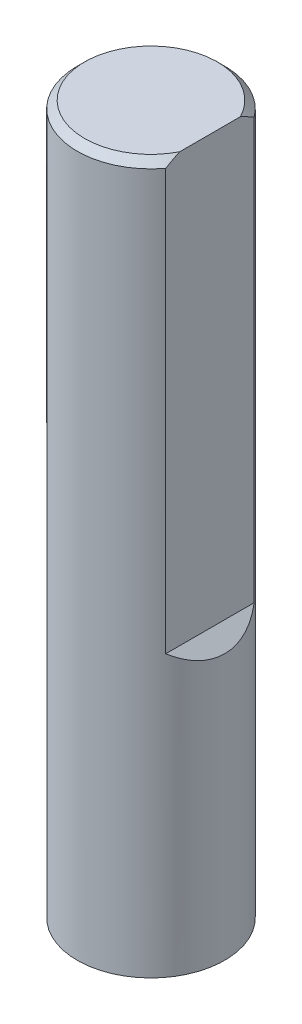
ISO-10303-21;
HEADER;
FILE_DESCRIPTION(('STEP AP214'),'2;1');
FILE_NAME('part.step','',(''),(''),'','','');
FILE_SCHEMA(('AUTOMOTIVE_DESIGN { 1 0 10303 214 1 1 1 1 }'));
ENDSEC;
DATA;
#1=APPLICATION_CONTEXT('core data for automotive mechanical design processes');
#2=APPLICATION_PROTOCOL_DEFINITION('international standard','automotive_design',2000,#1);
#3=PRODUCT_CONTEXT('',#1,'mechanical');
#4=PRODUCT('Part','Part','',(#3));
#5=PRODUCT_RELATED_PRODUCT_CATEGORY('part','',(#4));
#6=PRODUCT_DEFINITION_FORMATION('','',#4);
#7=PRODUCT_DEFINITION_CONTEXT('part definition',#1,'design');
#8=PRODUCT_DEFINITION('design','',#6,#7);
#9=PRODUCT_DEFINITION_SHAPE('','',#8);
#10=(LENGTH_UNIT() NAMED_UNIT(*) SI_UNIT(.MILLI.,.METRE.));
#11=(NAMED_UNIT(*) PLANE_ANGLE_UNIT() SI_UNIT($,.RADIAN.));
#12=(NAMED_UNIT(*) SI_UNIT($,.STERADIAN.) SOLID_ANGLE_UNIT());
#13=UNCERTAINTY_MEASURE_WITH_UNIT(LENGTH_MEASURE(1.E-05),#10,'distance_accuracy_value','');
#14=(GEOMETRIC_REPRESENTATION_CONTEXT(3) GLOBAL_UNCERTAINTY_ASSIGNED_CONTEXT((#13)) GLOBAL_UNIT_ASSIGNED_CONTEXT((#10,
#11,#12)) REPRESENTATION_CONTEXT('',''));
#15=CARTESIAN_POINT('',(0.,0.,0.));
#16=DIRECTION('',(0.,0.,1.));
#17=DIRECTION('',(1.,0.,0.));
#18=AXIS2_PLACEMENT_3D('',#15,#16,#17);
#19=CARTESIAN_POINT('',(0.,40.,0.));
#20=DIRECTION('',(0.,1.,0.));
#21=DIRECTION('',(1.,0.,0.));
#22=AXIS2_PLACEMENT_3D('',#19,#20,#21);
#23=PLANE('',#22);
#24=CARTESIAN_POINT('',(0.,40.,0.));
#25=DIRECTION('',(0.,1.,0.));
#26=DIRECTION('',(1.,0.,0.));
#27=AXIS2_PLACEMENT_3D('',#24,#25,#26);
#28=CIRCLE('',#27,2.5);
#29=CARTESIAN_POINT('',(-2.5,40.,0.));
#30=VERTEX_POINT('',#29);
#31=EDGE_CURVE('E11',#30,#30,#28,.T.);
#32=ORIENTED_EDGE('',*,*,#31,.F.);
#33=EDGE_LOOP('',(#32));
#34=FACE_BOUND('',#33,.T.);
#35=ADVANCED_FACE('F16',(#34),#23,.F.);
#36=CARTESIAN_POINT('',(0.,40.,0.));
#37=DIRECTION('',(0.,1.,0.));
#38=DIRECTION('',(1.,0.,0.));
#39=AXIS2_PLACEMENT_3D('',#36,#37,#38);
#40=CYLINDRICAL_SURFACE('',#39,2.5);
#41=CARTESIAN_POINT('',(0.,63.75,0.));
#42=DIRECTION('',(0.,1.,0.));
#43=DIRECTION('',(-1.,0.,0.));
#44=AXIS2_PLACEMENT_3D('',#41,#42,#43);
#45=CIRCLE('',#44,2.5);
#46=CARTESIAN_POINT('',(2.,63.75,-1.5));
#47=VERTEX_POINT('',#46);
#48=CARTESIAN_POINT('',(-2.5,63.75,0.));
#49=VERTEX_POINT('',#48);
#50=EDGE_CURVE('E84',#47,#49,#45,.T.);
#51=ORIENTED_EDGE('',*,*,#50,.F.);
#52=DIRECTION('',(0.,-1.,0.));
#53=VECTOR('',#52,1.);
#54=CARTESIAN_POINT('',(2.,40.,-1.5));
#55=LINE('',#54,#53);
#56=CARTESIAN_POINT('',(2.,49.5,-1.5));
#57=VERTEX_POINT('',#56);
#58=EDGE_CURVE('E79',#47,#57,#55,.T.);
#59=ORIENTED_EDGE('',*,*,#58,.T.);
#60=CARTESIAN_POINT('',(0.,51.5,0.));
#61=DIRECTION('',(-0.707106781186563,-0.707106781186532,0.));
#62=DIRECTION('',(0.707106781186532,-0.707106781186563,0.));
#63=AXIS2_PLACEMENT_3D('',#60,#61,#62);
#64=ELLIPSE('',#63,3.53553390593282,2.5);
#65=CARTESIAN_POINT('',(2.,49.5,1.5));
#66=VERTEX_POINT('',#65);
#67=EDGE_CURVE('E73',#57,#66,#64,.T.);
#68=ORIENTED_EDGE('',*,*,#67,.T.);
#69=DIRECTION('',(0.,1.,0.));
#70=VECTOR('',#69,1.);
#71=CARTESIAN_POINT('',(2.,40.,1.5));
#72=LINE('',#71,#70);
#73=CARTESIAN_POINT('',(2.,63.75,1.5));
#74=VERTEX_POINT('',#73);
#75=EDGE_CURVE('E20',#66,#74,#72,.T.);
#76=ORIENTED_EDGE('',*,*,#75,.T.);
#77=CARTESIAN_POINT('',(0.,63.75,0.));
#78=DIRECTION('',(0.,1.,0.));
#79=DIRECTION('',(-1.,0.,0.));
#80=AXIS2_PLACEMENT_3D('',#77,#78,#79);
#81=CIRCLE('',#80,2.5);
#82=EDGE_CURVE('E74',#49,#74,#81,.T.);
#83=ORIENTED_EDGE('',*,*,#82,.F.);
#84=DIRECTION('',(0.,-1.,0.));
#85=VECTOR('',#84,1.);
#86=CARTESIAN_POINT('',(-2.5,40.,0.));
#87=LINE('',#86,#85);
#88=EDGE_CURVE('E27',#49,#30,#87,.T.);
#89=ORIENTED_EDGE('',*,*,#88,.T.);
#90=ORIENTED_EDGE('',*,*,#31,.T.);
#91=ORIENTED_EDGE('',*,*,#88,.F.);
#92=EDGE_LOOP('',(#51,#59,#68,#76,#83,#89,#90,#91));
#93=FACE_BOUND('',#92,.T.);
#94=ADVANCED_FACE('F117',(#93),#40,.T.);
#95=CARTESIAN_POINT('',(2.,64.,0.));
#96=DIRECTION('',(-1.,0.,0.));
#97=DIRECTION('',(0.,0.,1.));
#98=AXIS2_PLACEMENT_3D('',#95,#96,#97);
#99=PLANE('',#98);
#100=CARTESIAN_POINT('',(2.,64.,-1.03077640640443));
#101=CARTESIAN_POINT('',(2.,63.8981758716617,-1.25304021389711));
#102=CARTESIAN_POINT('',(2.,63.75,-1.5));
#103=(BOUNDED_CURVE() B_SPLINE_CURVE(2,(#100,#101,#102),.UNSPECIFIED.,.F.,
.F.) B_SPLINE_CURVE_WITH_KNOTS((3,3),(0.,0.154410798626074),
.UNSPECIFIED.) CURVE() GEOMETRIC_REPRESENTATION_ITEM() RATIONAL_B_SPLINE_CURVE((1.,
1.05443946143234,1.10099292692392)) REPRESENTATION_ITEM(''));
#104=CARTESIAN_POINT('',(2.,64.,-1.03077640640441));
#105=VERTEX_POINT('',#104);
#106=EDGE_CURVE('E77',#105,#47,#103,.T.);
#107=ORIENTED_EDGE('',*,*,#106,.F.);
#108=DIRECTION('',(0.,0.,-1.));
#109=VECTOR('',#108,1.);
#110=CARTESIAN_POINT('',(2.,64.,0.));
#111=LINE('',#110,#109);
#112=CARTESIAN_POINT('',(2.,64.,1.03077640640441));
#113=VERTEX_POINT('',#112);
#114=EDGE_CURVE('E64',#113,#105,#111,.T.);
#115=ORIENTED_EDGE('',*,*,#114,.F.);
#116=CARTESIAN_POINT('',(2.,63.75,1.5));
#117=CARTESIAN_POINT('',(2.,63.8981758716617,1.25304021389713));
#118=CARTESIAN_POINT('',(2.,64.,1.03077640640443));
#119=(BOUNDED_CURVE() B_SPLINE_CURVE(2,(#116,#117,#118),.UNSPECIFIED.,.F.,
.F.) B_SPLINE_CURVE_WITH_KNOTS((3,3),(1.97747990476482,2.13189070339088),
.UNSPECIFIED.) CURVE() GEOMETRIC_REPRESENTATION_ITEM() RATIONAL_B_SPLINE_CURVE((1.10099292692391,
1.05443946143233,1.)) REPRESENTATION_ITEM(''));
#120=EDGE_CURVE('E88',#74,#113,#119,.T.);
#121=ORIENTED_EDGE('',*,*,#120,.F.);
#122=ORIENTED_EDGE('',*,*,#75,.F.);
#123=DIRECTION('',(0.,0.,1.));
#124=VECTOR('',#123,1.);
#125=CARTESIAN_POINT('',(2.,49.5,0.));
#126=LINE('',#125,#124);
#127=EDGE_CURVE('E111',#57,#66,#126,.T.);
#128=ORIENTED_EDGE('',*,*,#127,.F.);
#129=ORIENTED_EDGE('',*,*,#58,.F.);
#130=EDGE_LOOP('',(#107,#115,#121,#122,#128,#129));
#131=FACE_BOUND('',#130,.T.);
#132=ADVANCED_FACE('F18',(#131),#99,.F.);
#133=CARTESIAN_POINT('',(2.,49.5,0.));
#134=DIRECTION('',(-0.707106781186563,-0.707106781186532,0.));
#135=DIRECTION('',(-0.707106781186532,0.707106781186563,0.));
#136=AXIS2_PLACEMENT_3D('',#133,#134,#135);
#137=PLANE('',#136);
#138=ORIENTED_EDGE('',*,*,#67,.F.);
#139=ORIENTED_EDGE('',*,*,#127,.T.);
#140=EDGE_LOOP('',(#138,#139));
#141=FACE_BOUND('',#140,.T.);
#142=ADVANCED_FACE('F121',(#141),#137,.F.);
#143=CARTESIAN_POINT('',(0.,64.,0.));
#144=DIRECTION('',(0.,1.,0.));
#145=DIRECTION('',(1.,0.,0.));
#146=AXIS2_PLACEMENT_3D('',#143,#144,#145);
#147=PLANE('',#146);
#148=CARTESIAN_POINT('',(0.,64.,0.));
#149=DIRECTION('',(0.,-1.,0.));
#150=DIRECTION('',(-1.,0.,0.));
#151=AXIS2_PLACEMENT_3D('',#148,#149,#150);
#152=CIRCLE('',#151,2.25);
#153=EDGE_CURVE('E68',#113,#105,#152,.T.);
#154=ORIENTED_EDGE('',*,*,#153,.F.);
#155=ORIENTED_EDGE('',*,*,#114,.T.);
#156=EDGE_LOOP('',(#154,#155));
#157=FACE_BOUND('',#156,.T.);
#158=ADVANCED_FACE('F66',(#157),#147,.T.);
#159=CARTESIAN_POINT('',(0.,63.875,0.));
#160=DIRECTION('',(0.,-1.,0.));
#161=DIRECTION('',(-1.,0.,0.));
#162=AXIS2_PLACEMENT_3D('',#159,#160,#161);
#163=CONICAL_SURFACE('',#162,2.375,0.785398163397441);
#164=ORIENTED_EDGE('',*,*,#120,.T.);
#165=ORIENTED_EDGE('',*,*,#153,.T.);
#166=ORIENTED_EDGE('',*,*,#106,.T.);
#167=ORIENTED_EDGE('',*,*,#50,.T.);
#168=ORIENTED_EDGE('',*,*,#82,.T.);
#169=EDGE_LOOP('',(#164,#165,#166,#167,#168));
#170=FACE_BOUND('',#169,.T.);
#171=ADVANCED_FACE('F86',(#170),#163,.T.);
#172=CLOSED_SHELL('',(#35,#94,#132,#142,#158,#171));
#173=MANIFOLD_SOLID_BREP('B1',#172);
#174=ADVANCED_BREP_SHAPE_REPRESENTATION('',(#18,#173),#14);
#175=SHAPE_DEFINITION_REPRESENTATION(#9,#174);
ENDSEC;
END-ISO-10303-21;
